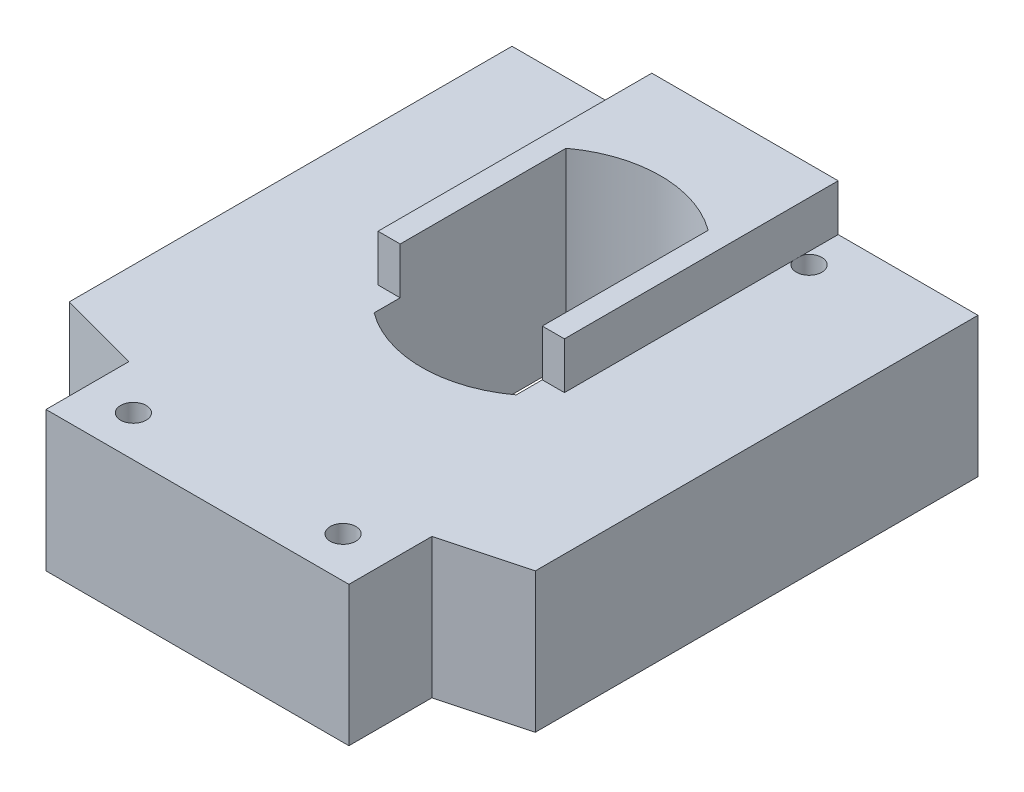
ISO-10303-21;
HEADER;
FILE_DESCRIPTION(('STEP AP214'),'2;1');
FILE_NAME('part.step','',(''),(''),'','','');
FILE_SCHEMA(('AUTOMOTIVE_DESIGN { 1 0 10303 214 1 1 1 1 }'));
ENDSEC;
DATA;
#1=APPLICATION_CONTEXT('core data for automotive mechanical design processes');
#2=APPLICATION_PROTOCOL_DEFINITION('international standard','automotive_design',2000,#1);
#3=PRODUCT_CONTEXT('',#1,'mechanical');
#4=PRODUCT('Part','Part','',(#3));
#5=PRODUCT_RELATED_PRODUCT_CATEGORY('part','',(#4));
#6=PRODUCT_DEFINITION_FORMATION('','',#4);
#7=PRODUCT_DEFINITION_CONTEXT('part definition',#1,'design');
#8=PRODUCT_DEFINITION('design','',#6,#7);
#9=PRODUCT_DEFINITION_SHAPE('','',#8);
#10=(LENGTH_UNIT() NAMED_UNIT(*) SI_UNIT(.MILLI.,.METRE.));
#11=(NAMED_UNIT(*) PLANE_ANGLE_UNIT() SI_UNIT($,.RADIAN.));
#12=(NAMED_UNIT(*) SI_UNIT($,.STERADIAN.) SOLID_ANGLE_UNIT());
#13=UNCERTAINTY_MEASURE_WITH_UNIT(LENGTH_MEASURE(1.E-05),#10,'distance_accuracy_value','');
#14=(GEOMETRIC_REPRESENTATION_CONTEXT(3) GLOBAL_UNCERTAINTY_ASSIGNED_CONTEXT((#13)) GLOBAL_UNIT_ASSIGNED_CONTEXT((#10,
#11,#12)) REPRESENTATION_CONTEXT('',''));
#15=CARTESIAN_POINT('',(0.,0.,0.));
#16=DIRECTION('',(0.,0.,1.));
#17=DIRECTION('',(1.,0.,0.));
#18=AXIS2_PLACEMENT_3D('',#15,#16,#17);
#19=CARTESIAN_POINT('',(0.,-12.,0.));
#20=DIRECTION('',(0.,1.,0.));
#21=DIRECTION('',(0.,0.,1.));
#22=AXIS2_PLACEMENT_3D('',#19,#20,#21);
#23=PLANE('',#22);
#24=CARTESIAN_POINT('',(-9.,-12.,-20.));
#25=DIRECTION('',(0.,1.,0.));
#26=DIRECTION('',(0.,0.,1.));
#27=AXIS2_PLACEMENT_3D('',#24,#25,#26);
#28=CIRCLE('',#27,1.1);
#29=CARTESIAN_POINT('',(-9.,-12.,-18.9));
#30=VERTEX_POINT('',#29);
#31=EDGE_CURVE('E283',#30,#30,#28,.T.);
#32=ORIENTED_EDGE('',*,*,#31,.T.);
#33=EDGE_LOOP('',(#32));
#34=FACE_BOUND('',#33,.T.);
#35=CARTESIAN_POINT('',(9.,-12.,-20.));
#36=DIRECTION('',(0.,1.,0.));
#37=DIRECTION('',(0.,0.,1.));
#38=AXIS2_PLACEMENT_3D('',#35,#36,#37);
#39=CIRCLE('',#38,1.1);
#40=CARTESIAN_POINT('',(9.,-12.,-18.9));
#41=VERTEX_POINT('',#40);
#42=EDGE_CURVE('E280',#41,#41,#39,.T.);
#43=ORIENTED_EDGE('',*,*,#42,.T.);
#44=EDGE_LOOP('',(#43));
#45=FACE_BOUND('',#44,.T.);
#46=CARTESIAN_POINT('',(-9.,-12.,20.));
#47=DIRECTION('',(0.,1.,0.));
#48=DIRECTION('',(0.,0.,1.));
#49=AXIS2_PLACEMENT_3D('',#46,#47,#48);
#50=CIRCLE('',#49,1.1);
#51=CARTESIAN_POINT('',(-9.,-12.,21.1));
#52=VERTEX_POINT('',#51);
#53=EDGE_CURVE('E277',#52,#52,#50,.T.);
#54=ORIENTED_EDGE('',*,*,#53,.T.);
#55=EDGE_LOOP('',(#54));
#56=FACE_BOUND('',#55,.T.);
#57=CARTESIAN_POINT('',(9.,-12.,20.));
#58=DIRECTION('',(0.,1.,0.));
#59=DIRECTION('',(0.,0.,1.));
#60=AXIS2_PLACEMENT_3D('',#57,#58,#59);
#61=CIRCLE('',#60,1.1);
#62=CARTESIAN_POINT('',(9.,-12.,21.1));
#63=VERTEX_POINT('',#62);
#64=EDGE_CURVE('E274',#63,#63,#61,.T.);
#65=ORIENTED_EDGE('',*,*,#64,.T.);
#66=EDGE_LOOP('',(#65));
#67=FACE_BOUND('',#66,.T.);
#68=DIRECTION('',(0.965925826289069,0.,0.258819045102518));
#69=VECTOR('',#68,1.);
#70=CARTESIAN_POINT('',(-4.96474596215555,-12.,18.5286841774372));
#71=LINE('',#70,#69);
#72=CARTESIAN_POINT('',(-20.,-12.,14.5));
#73=VERTEX_POINT('',#72);
#74=CARTESIAN_POINT('',(-13.,-12.,16.3756443470178));
#75=VERTEX_POINT('',#74);
#76=EDGE_CURVE('E252',#73,#75,#71,.T.);
#77=ORIENTED_EDGE('',*,*,#76,.F.);
#78=DIRECTION('',(0.,0.,1.));
#79=VECTOR('',#78,1.);
#80=CARTESIAN_POINT('',(-20.,-12.,0.));
#81=LINE('',#80,#79);
#82=CARTESIAN_POINT('',(-20.,-12.,-23.5));
#83=VERTEX_POINT('',#82);
#84=EDGE_CURVE('E271',#83,#73,#81,.T.);
#85=ORIENTED_EDGE('',*,*,#84,.F.);
#86=DIRECTION('',(-1.,0.,0.));
#87=VECTOR('',#86,1.);
#88=CARTESIAN_POINT('',(0.,-12.,-23.5));
#89=LINE('',#88,#87);
#90=CARTESIAN_POINT('',(20.,-12.,-23.5));
#91=VERTEX_POINT('',#90);
#92=EDGE_CURVE('E268',#91,#83,#89,.T.);
#93=ORIENTED_EDGE('',*,*,#92,.F.);
#94=DIRECTION('',(0.,0.,1.));
#95=VECTOR('',#94,1.);
#96=CARTESIAN_POINT('',(20.,-12.,0.));
#97=LINE('',#96,#95);
#98=CARTESIAN_POINT('',(20.,-12.,14.5));
#99=VERTEX_POINT('',#98);
#100=EDGE_CURVE('E266',#91,#99,#97,.T.);
#101=ORIENTED_EDGE('',*,*,#100,.T.);
#102=DIRECTION('',(-0.965925826289069,0.,0.258819045102518));
#103=VECTOR('',#102,1.);
#104=CARTESIAN_POINT('',(4.96474596215555,-12.,18.5286841774372));
#105=LINE('',#104,#103);
#106=CARTESIAN_POINT('',(13.,-12.,16.3756443470178));
#107=VERTEX_POINT('',#106);
#108=EDGE_CURVE('E264',#99,#107,#105,.T.);
#109=ORIENTED_EDGE('',*,*,#108,.T.);
#110=DIRECTION('',(0.,0.,1.));
#111=VECTOR('',#110,1.);
#112=CARTESIAN_POINT('',(13.,-12.,0.));
#113=LINE('',#112,#111);
#114=CARTESIAN_POINT('',(13.,-12.,23.5));
#115=VERTEX_POINT('',#114);
#116=EDGE_CURVE('E262',#107,#115,#113,.T.);
#117=ORIENTED_EDGE('',*,*,#116,.T.);
#118=DIRECTION('',(1.,0.,0.));
#119=VECTOR('',#118,1.);
#120=CARTESIAN_POINT('',(0.,-12.,23.5));
#121=LINE('',#120,#119);
#122=CARTESIAN_POINT('',(-13.,-12.,23.5));
#123=VERTEX_POINT('',#122);
#124=EDGE_CURVE('E259',#123,#115,#121,.T.);
#125=ORIENTED_EDGE('',*,*,#124,.F.);
#126=DIRECTION('',(0.,0.,1.));
#127=VECTOR('',#126,1.);
#128=CARTESIAN_POINT('',(-13.,-12.,0.));
#129=LINE('',#128,#127);
#130=EDGE_CURVE('E255',#75,#123,#129,.T.);
#131=ORIENTED_EDGE('',*,*,#130,.F.);
#132=EDGE_LOOP('',(#77,#85,#93,#101,#109,#117,#125,#131));
#133=FACE_BOUND('',#132,.T.);
#134=DIRECTION('',(0.,0.,1.));
#135=VECTOR('',#134,1.);
#136=CARTESIAN_POINT('',(6.1,-12.,0.));
#137=LINE('',#136,#135);
#138=CARTESIAN_POINT('',(6.1,-12.,-14.2372628949184));
#139=VERTEX_POINT('',#138);
#140=CARTESIAN_POINT('',(6.1,-12.,2.23726289491844));
#141=VERTEX_POINT('',#140);
#142=EDGE_CURVE('E198',#139,#141,#137,.T.);
#143=ORIENTED_EDGE('',*,*,#142,.F.);
#144=CARTESIAN_POINT('',(0.,-12.,-5.99999999999999));
#145=DIRECTION('',(0.,1.,0.));
#146=DIRECTION('',(0.,0.,1.));
#147=AXIS2_PLACEMENT_3D('',#144,#145,#146);
#148=CIRCLE('',#147,10.25);
#149=CARTESIAN_POINT('',(-6.1,-12.,-14.2372628949184));
#150=VERTEX_POINT('',#149);
#151=EDGE_CURVE('E182',#139,#150,#148,.T.);
#152=ORIENTED_EDGE('',*,*,#151,.T.);
#153=DIRECTION('',(0.,0.,1.));
#154=VECTOR('',#153,1.);
#155=CARTESIAN_POINT('',(-6.1,-12.,0.));
#156=LINE('',#155,#154);
#157=CARTESIAN_POINT('',(-6.1,-12.,2.23726289491844));
#158=VERTEX_POINT('',#157);
#159=EDGE_CURVE('E56',#150,#158,#156,.T.);
#160=ORIENTED_EDGE('',*,*,#159,.T.);
#161=EDGE_CURVE('E186',#158,#141,#148,.T.);
#162=ORIENTED_EDGE('',*,*,#161,.T.);
#163=EDGE_LOOP('',(#143,#152,#160,#162));
#164=FACE_BOUND('',#163,.T.);
#165=ADVANCED_FACE('F41',(#34,#45,#56,#67,#133,#164),#23,.F.);
#166=CARTESIAN_POINT('',(0.,0.,0.));
#167=DIRECTION('',(0.,1.,0.));
#168=DIRECTION('',(0.,0.,1.));
#169=AXIS2_PLACEMENT_3D('',#166,#167,#168);
#170=PLANE('',#169);
#171=CARTESIAN_POINT('',(9.,0.,20.));
#172=DIRECTION('',(0.,1.,0.));
#173=DIRECTION('',(0.,0.,1.));
#174=AXIS2_PLACEMENT_3D('',#171,#172,#173);
#175=CIRCLE('',#174,1.1);
#176=CARTESIAN_POINT('',(9.,0.,21.1));
#177=VERTEX_POINT('',#176);
#178=EDGE_CURVE('E308',#177,#177,#175,.T.);
#179=ORIENTED_EDGE('',*,*,#178,.F.);
#180=EDGE_LOOP('',(#179));
#181=FACE_BOUND('',#180,.T.);
#182=CARTESIAN_POINT('',(-9.,0.,20.));
#183=DIRECTION('',(0.,1.,0.));
#184=DIRECTION('',(0.,0.,1.));
#185=AXIS2_PLACEMENT_3D('',#182,#183,#184);
#186=CIRCLE('',#185,1.1);
#187=CARTESIAN_POINT('',(-9.,0.,21.1));
#188=VERTEX_POINT('',#187);
#189=EDGE_CURVE('E311',#188,#188,#186,.T.);
#190=ORIENTED_EDGE('',*,*,#189,.F.);
#191=EDGE_LOOP('',(#190));
#192=FACE_BOUND('',#191,.T.);
#193=DIRECTION('',(1.,0.,0.));
#194=VECTOR('',#193,1.);
#195=CARTESIAN_POINT('',(0.,0.,0.));
#196=LINE('',#195,#194);
#197=CARTESIAN_POINT('',(6.1,0.,0.));
#198=VERTEX_POINT('',#197);
#199=CARTESIAN_POINT('',(8.,0.,0.));
#200=VERTEX_POINT('',#199);
#201=EDGE_CURVE('E224',#198,#200,#196,.T.);
#202=ORIENTED_EDGE('',*,*,#201,.F.);
#203=DIRECTION('',(0.,0.,1.));
#204=VECTOR('',#203,1.);
#205=CARTESIAN_POINT('',(6.1,0.,0.));
#206=LINE('',#205,#204);
#207=CARTESIAN_POINT('',(6.1,0.,2.23726289491844));
#208=VERTEX_POINT('',#207);
#209=EDGE_CURVE('E213',#198,#208,#206,.T.);
#210=ORIENTED_EDGE('',*,*,#209,.T.);
#211=CARTESIAN_POINT('',(0.,0.,-5.99999999999999));
#212=DIRECTION('',(0.,1.,0.));
#213=DIRECTION('',(0.,0.,1.));
#214=AXIS2_PLACEMENT_3D('',#211,#212,#213);
#215=CIRCLE('',#214,10.25);
#216=CARTESIAN_POINT('',(-6.1,0.,2.23726289491844));
#217=VERTEX_POINT('',#216);
#218=EDGE_CURVE('E11',#217,#208,#215,.T.);
#219=ORIENTED_EDGE('',*,*,#218,.F.);
#220=DIRECTION('',(0.,0.,1.));
#221=VECTOR('',#220,1.);
#222=CARTESIAN_POINT('',(-6.1,0.,0.));
#223=LINE('',#222,#221);
#224=CARTESIAN_POINT('',(-6.1,0.,0.));
#225=VERTEX_POINT('',#224);
#226=EDGE_CURVE('E207',#225,#217,#223,.T.);
#227=ORIENTED_EDGE('',*,*,#226,.F.);
#228=CARTESIAN_POINT('',(-8.,0.,0.));
#229=VERTEX_POINT('',#228);
#230=EDGE_CURVE('E221',#229,#225,#196,.T.);
#231=ORIENTED_EDGE('',*,*,#230,.F.);
#232=DIRECTION('',(0.,0.,1.));
#233=VECTOR('',#232,1.);
#234=CARTESIAN_POINT('',(-8.,0.,-39.9924225024706));
#235=LINE('',#234,#233);
#236=CARTESIAN_POINT('',(-8.,0.,-19.5417424305044));
#237=VERTEX_POINT('',#236);
#238=EDGE_CURVE('E250',#237,#229,#235,.T.);
#239=ORIENTED_EDGE('',*,*,#238,.F.);
#240=CARTESIAN_POINT('',(-9.,0.,-20.));
#241=DIRECTION('',(0.,1.,0.));
#242=DIRECTION('',(0.,0.,1.));
#243=AXIS2_PLACEMENT_3D('',#240,#241,#242);
#244=CIRCLE('',#243,1.1);
#245=CARTESIAN_POINT('',(-8.,0.,-20.4582575694956));
#246=VERTEX_POINT('',#245);
#247=EDGE_CURVE('E318',#246,#237,#244,.T.);
#248=ORIENTED_EDGE('',*,*,#247,.F.);
#249=CARTESIAN_POINT('',(-8.,0.,-23.5));
#250=VERTEX_POINT('',#249);
#251=EDGE_CURVE('E228',#250,#246,#235,.T.);
#252=ORIENTED_EDGE('',*,*,#251,.F.);
#253=DIRECTION('',(-1.,0.,0.));
#254=VECTOR('',#253,1.);
#255=CARTESIAN_POINT('',(0.,0.,-23.5));
#256=LINE('',#255,#254);
#257=CARTESIAN_POINT('',(-20.,0.,-23.5));
#258=VERTEX_POINT('',#257);
#259=EDGE_CURVE('E302',#250,#258,#256,.T.);
#260=ORIENTED_EDGE('',*,*,#259,.T.);
#261=DIRECTION('',(0.,0.,1.));
#262=VECTOR('',#261,1.);
#263=CARTESIAN_POINT('',(-20.,0.,0.));
#264=LINE('',#263,#262);
#265=CARTESIAN_POINT('',(-20.,0.,14.5));
#266=VERTEX_POINT('',#265);
#267=EDGE_CURVE('E305',#258,#266,#264,.T.);
#268=ORIENTED_EDGE('',*,*,#267,.T.);
#269=DIRECTION('',(0.965925826289069,0.,0.258819045102518));
#270=VECTOR('',#269,1.);
#271=CARTESIAN_POINT('',(-4.96474596215555,0.,18.5286841774372));
#272=LINE('',#271,#270);
#273=CARTESIAN_POINT('',(-13.,0.,16.3756443470178));
#274=VERTEX_POINT('',#273);
#275=EDGE_CURVE('E238',#266,#274,#272,.T.);
#276=ORIENTED_EDGE('',*,*,#275,.T.);
#277=DIRECTION('',(0.,0.,1.));
#278=VECTOR('',#277,1.);
#279=CARTESIAN_POINT('',(-13.,0.,0.));
#280=LINE('',#279,#278);
#281=CARTESIAN_POINT('',(-13.,0.,23.5));
#282=VERTEX_POINT('',#281);
#283=EDGE_CURVE('E289',#274,#282,#280,.T.);
#284=ORIENTED_EDGE('',*,*,#283,.T.);
#285=DIRECTION('',(1.,0.,0.));
#286=VECTOR('',#285,1.);
#287=CARTESIAN_POINT('',(0.,0.,23.5));
#288=LINE('',#287,#286);
#289=CARTESIAN_POINT('',(13.,0.,23.5));
#290=VERTEX_POINT('',#289);
#291=EDGE_CURVE('E292',#282,#290,#288,.T.);
#292=ORIENTED_EDGE('',*,*,#291,.T.);
#293=DIRECTION('',(0.,0.,1.));
#294=VECTOR('',#293,1.);
#295=CARTESIAN_POINT('',(13.,0.,0.));
#296=LINE('',#295,#294);
#297=CARTESIAN_POINT('',(13.,0.,16.3756443470178));
#298=VERTEX_POINT('',#297);
#299=EDGE_CURVE('E295',#298,#290,#296,.T.);
#300=ORIENTED_EDGE('',*,*,#299,.F.);
#301=DIRECTION('',(-0.965925826289069,0.,0.258819045102518));
#302=VECTOR('',#301,1.);
#303=CARTESIAN_POINT('',(4.96474596215555,0.,18.5286841774372));
#304=LINE('',#303,#302);
#305=CARTESIAN_POINT('',(20.,0.,14.5));
#306=VERTEX_POINT('',#305);
#307=EDGE_CURVE('E298',#306,#298,#304,.T.);
#308=ORIENTED_EDGE('',*,*,#307,.F.);
#309=DIRECTION('',(0.,0.,1.));
#310=VECTOR('',#309,1.);
#311=CARTESIAN_POINT('',(20.,0.,0.));
#312=LINE('',#311,#310);
#313=CARTESIAN_POINT('',(20.,0.,-23.5));
#314=VERTEX_POINT('',#313);
#315=EDGE_CURVE('E300',#314,#306,#312,.T.);
#316=ORIENTED_EDGE('',*,*,#315,.F.);
#317=CARTESIAN_POINT('',(8.,0.,-23.5));
#318=VERTEX_POINT('',#317);
#319=EDGE_CURVE('E303',#314,#318,#256,.T.);
#320=ORIENTED_EDGE('',*,*,#319,.T.);
#321=DIRECTION('',(0.,0.,1.));
#322=VECTOR('',#321,1.);
#323=CARTESIAN_POINT('',(8.,0.,-39.9924225024706));
#324=LINE('',#323,#322);
#325=CARTESIAN_POINT('',(8.,0.,-20.4582575694956));
#326=VERTEX_POINT('',#325);
#327=EDGE_CURVE('E244',#318,#326,#324,.T.);
#328=ORIENTED_EDGE('',*,*,#327,.T.);
#329=CARTESIAN_POINT('',(9.,0.,-20.));
#330=DIRECTION('',(0.,1.,0.));
#331=DIRECTION('',(0.,0.,1.));
#332=AXIS2_PLACEMENT_3D('',#329,#330,#331);
#333=CIRCLE('',#332,1.1);
#334=CARTESIAN_POINT('',(8.,0.,-19.5417424305044));
#335=VERTEX_POINT('',#334);
#336=EDGE_CURVE('E314',#335,#326,#333,.T.);
#337=ORIENTED_EDGE('',*,*,#336,.F.);
#338=EDGE_CURVE('E247',#335,#200,#324,.T.);
#339=ORIENTED_EDGE('',*,*,#338,.T.);
#340=EDGE_LOOP('',(#202,#210,#219,#227,#231,#239,#248,#252,#260,#268,#276,#284,#292,#300,#308,
#316,#320,#328,#337,#339));
#341=FACE_BOUND('',#340,.T.);
#342=ADVANCED_FACE('F345',(#181,#192,#341),#170,.T.);
#343=CARTESIAN_POINT('',(0.,4.,-39.9924225024706));
#344=DIRECTION('',(0.,-1.,0.));
#345=DIRECTION('',(0.,0.,-1.));
#346=AXIS2_PLACEMENT_3D('',#343,#344,#345);
#347=PLANE('',#346);
#348=DIRECTION('',(0.,0.,1.));
#349=VECTOR('',#348,1.);
#350=CARTESIAN_POINT('',(6.1,4.,0.));
#351=LINE('',#350,#349);
#352=CARTESIAN_POINT('',(6.1,4.,-14.2372628949184));
#353=VERTEX_POINT('',#352);
#354=CARTESIAN_POINT('',(6.1,4.,0.));
#355=VERTEX_POINT('',#354);
#356=EDGE_CURVE('E189',#353,#355,#351,.T.);
#357=ORIENTED_EDGE('',*,*,#356,.T.);
#358=DIRECTION('',(1.,0.,0.));
#359=VECTOR('',#358,1.);
#360=CARTESIAN_POINT('',(0.,4.,0.));
#361=LINE('',#360,#359);
#362=CARTESIAN_POINT('',(8.,4.,0.));
#363=VERTEX_POINT('',#362);
#364=EDGE_CURVE('E232',#355,#363,#361,.T.);
#365=ORIENTED_EDGE('',*,*,#364,.T.);
#366=DIRECTION('',(0.,0.,1.));
#367=VECTOR('',#366,1.);
#368=CARTESIAN_POINT('',(8.,4.,-39.9924225024706));
#369=LINE('',#368,#367);
#370=CARTESIAN_POINT('',(8.,4.,-23.5));
#371=VERTEX_POINT('',#370);
#372=EDGE_CURVE('E234',#371,#363,#369,.T.);
#373=ORIENTED_EDGE('',*,*,#372,.F.);
#374=DIRECTION('',(1.,0.,0.));
#375=VECTOR('',#374,1.);
#376=CARTESIAN_POINT('',(0.,4.,-23.5));
#377=LINE('',#376,#375);
#378=CARTESIAN_POINT('',(-8.,4.,-23.5));
#379=VERTEX_POINT('',#378);
#380=EDGE_CURVE('E235',#379,#371,#377,.T.);
#381=ORIENTED_EDGE('',*,*,#380,.F.);
#382=DIRECTION('',(0.,0.,1.));
#383=VECTOR('',#382,1.);
#384=CARTESIAN_POINT('',(-8.,4.,-39.9924225024706));
#385=LINE('',#384,#383);
#386=CARTESIAN_POINT('',(-8.,4.,0.));
#387=VERTEX_POINT('',#386);
#388=EDGE_CURVE('E216',#379,#387,#385,.T.);
#389=ORIENTED_EDGE('',*,*,#388,.T.);
#390=CARTESIAN_POINT('',(-6.1,4.,0.));
#391=VERTEX_POINT('',#390);
#392=EDGE_CURVE('E229',#387,#391,#361,.T.);
#393=ORIENTED_EDGE('',*,*,#392,.T.);
#394=DIRECTION('',(0.,0.,1.));
#395=VECTOR('',#394,1.);
#396=CARTESIAN_POINT('',(-6.1,4.,0.));
#397=LINE('',#396,#395);
#398=CARTESIAN_POINT('',(-6.1,4.,-14.2372628949184));
#399=VERTEX_POINT('',#398);
#400=EDGE_CURVE('E62',#399,#391,#397,.T.);
#401=ORIENTED_EDGE('',*,*,#400,.F.);
#402=CARTESIAN_POINT('',(0.,4.,-5.99999999999999));
#403=DIRECTION('',(0.,1.,0.));
#404=DIRECTION('',(0.,0.,1.));
#405=AXIS2_PLACEMENT_3D('',#402,#403,#404);
#406=CIRCLE('',#405,10.25);
#407=EDGE_CURVE('E180',#353,#399,#406,.T.);
#408=ORIENTED_EDGE('',*,*,#407,.F.);
#409=EDGE_LOOP('',(#357,#365,#373,#381,#389,#393,#401,#408));
#410=FACE_BOUND('',#409,.T.);
#411=ADVANCED_FACE('F195',(#410),#347,.F.);
#412=CARTESIAN_POINT('',(0.,0.,0.));
#413=DIRECTION('',(0.,0.,1.));
#414=DIRECTION('',(1.,0.,0.));
#415=AXIS2_PLACEMENT_3D('',#412,#413,#414);
#416=PLANE('',#415);
#417=ORIENTED_EDGE('',*,*,#364,.F.);
#418=DIRECTION('',(0.,-1.,0.));
#419=VECTOR('',#418,1.);
#420=CARTESIAN_POINT('',(6.1,0.,0.));
#421=LINE('',#420,#419);
#422=EDGE_CURVE('E49',#355,#198,#421,.T.);
#423=ORIENTED_EDGE('',*,*,#422,.T.);
#424=ORIENTED_EDGE('',*,*,#201,.T.);
#425=DIRECTION('',(0.,1.,0.));
#426=VECTOR('',#425,1.);
#427=CARTESIAN_POINT('',(8.,0.,0.));
#428=LINE('',#427,#426);
#429=EDGE_CURVE('E217',#200,#363,#428,.T.);
#430=ORIENTED_EDGE('',*,*,#429,.T.);
#431=EDGE_LOOP('',(#417,#423,#424,#430));
#432=FACE_BOUND('',#431,.T.);
#433=ADVANCED_FACE('F342',(#432),#416,.T.);
#434=CARTESIAN_POINT('',(-4.96474596215555,-12.,18.5286841774372));
#435=DIRECTION('',(-0.258819045102518,0.,0.965925826289069));
#436=DIRECTION('',(0.965925826289069,0.,0.258819045102518));
#437=AXIS2_PLACEMENT_3D('',#434,#435,#436);
#438=PLANE('',#437);
#439=ORIENTED_EDGE('',*,*,#275,.F.);
#440=DIRECTION('',(0.,1.,0.));
#441=VECTOR('',#440,1.);
#442=CARTESIAN_POINT('',(-20.,-12.,14.5));
#443=LINE('',#442,#441);
#444=EDGE_CURVE('E321',#73,#266,#443,.T.);
#445=ORIENTED_EDGE('',*,*,#444,.F.);
#446=ORIENTED_EDGE('',*,*,#76,.T.);
#447=DIRECTION('',(0.,1.,0.));
#448=VECTOR('',#447,1.);
#449=CARTESIAN_POINT('',(-13.,-12.,16.3756443470178));
#450=LINE('',#449,#448);
#451=EDGE_CURVE('E286',#75,#274,#450,.T.);
#452=ORIENTED_EDGE('',*,*,#451,.T.);
#453=EDGE_LOOP('',(#439,#445,#446,#452));
#454=FACE_BOUND('',#453,.T.);
#455=ADVANCED_FACE('F43',(#454),#438,.T.);
#456=CARTESIAN_POINT('',(-20.,-12.,0.));
#457=DIRECTION('',(-1.,0.,0.));
#458=DIRECTION('',(0.,0.,1.));
#459=AXIS2_PLACEMENT_3D('',#456,#457,#458);
#460=PLANE('',#459);
#461=ORIENTED_EDGE('',*,*,#267,.F.);
#462=DIRECTION('',(0.,1.,0.));
#463=VECTOR('',#462,1.);
#464=CARTESIAN_POINT('',(-20.,-12.,-23.5));
#465=LINE('',#464,#463);
#466=EDGE_CURVE('E323',#83,#258,#465,.T.);
#467=ORIENTED_EDGE('',*,*,#466,.F.);
#468=ORIENTED_EDGE('',*,*,#84,.T.);
#469=ORIENTED_EDGE('',*,*,#444,.T.);
#470=EDGE_LOOP('',(#461,#467,#468,#469));
#471=FACE_BOUND('',#470,.T.);
#472=ADVANCED_FACE('F411',(#471),#460,.T.);
#473=CARTESIAN_POINT('',(0.,-12.,-23.5));
#474=DIRECTION('',(0.,0.,-1.));
#475=DIRECTION('',(-1.,0.,0.));
#476=AXIS2_PLACEMENT_3D('',#473,#474,#475);
#477=PLANE('',#476);
#478=ORIENTED_EDGE('',*,*,#319,.F.);
#479=DIRECTION('',(0.,1.,0.));
#480=VECTOR('',#479,1.);
#481=CARTESIAN_POINT('',(20.,-12.,-23.5));
#482=LINE('',#481,#480);
#483=EDGE_CURVE('E326',#91,#314,#482,.T.);
#484=ORIENTED_EDGE('',*,*,#483,.F.);
#485=ORIENTED_EDGE('',*,*,#92,.T.);
#486=ORIENTED_EDGE('',*,*,#466,.T.);
#487=ORIENTED_EDGE('',*,*,#259,.F.);
#488=DIRECTION('',(0.,1.,0.));
#489=VECTOR('',#488,1.);
#490=CARTESIAN_POINT('',(-8.,0.,-23.5));
#491=LINE('',#490,#489);
#492=EDGE_CURVE('E220',#250,#379,#491,.T.);
#493=ORIENTED_EDGE('',*,*,#492,.T.);
#494=ORIENTED_EDGE('',*,*,#380,.T.);
#495=DIRECTION('',(0.,1.,0.));
#496=VECTOR('',#495,1.);
#497=CARTESIAN_POINT('',(8.,0.,-23.5));
#498=LINE('',#497,#496);
#499=EDGE_CURVE('E231',#318,#371,#498,.T.);
#500=ORIENTED_EDGE('',*,*,#499,.F.);
#501=EDGE_LOOP('',(#478,#484,#485,#486,#487,#493,#494,#500));
#502=FACE_BOUND('',#501,.T.);
#503=ADVANCED_FACE('F360',(#502),#477,.T.);
#504=CARTESIAN_POINT('',(20.,-12.,0.));
#505=DIRECTION('',(-1.,0.,0.));
#506=DIRECTION('',(0.,0.,1.));
#507=AXIS2_PLACEMENT_3D('',#504,#505,#506);
#508=PLANE('',#507);
#509=ORIENTED_EDGE('',*,*,#315,.T.);
#510=DIRECTION('',(0.,1.,0.));
#511=VECTOR('',#510,1.);
#512=CARTESIAN_POINT('',(20.,-12.,14.5));
#513=LINE('',#512,#511);
#514=EDGE_CURVE('E328',#99,#306,#513,.T.);
#515=ORIENTED_EDGE('',*,*,#514,.F.);
#516=ORIENTED_EDGE('',*,*,#100,.F.);
#517=ORIENTED_EDGE('',*,*,#483,.T.);
#518=EDGE_LOOP('',(#509,#515,#516,#517));
#519=FACE_BOUND('',#518,.T.);
#520=ADVANCED_FACE('F417',(#519),#508,.F.);
#521=CARTESIAN_POINT('',(4.96474596215555,-12.,18.5286841774372));
#522=DIRECTION('',(-0.258819045102518,0.,-0.965925826289069));
#523=DIRECTION('',(-0.965925826289069,0.,0.258819045102518));
#524=AXIS2_PLACEMENT_3D('',#521,#522,#523);
#525=PLANE('',#524);
#526=ORIENTED_EDGE('',*,*,#307,.T.);
#527=DIRECTION('',(0.,1.,0.));
#528=VECTOR('',#527,1.);
#529=CARTESIAN_POINT('',(13.,-12.,16.3756443470178));
#530=LINE('',#529,#528);
#531=EDGE_CURVE('E331',#107,#298,#530,.T.);
#532=ORIENTED_EDGE('',*,*,#531,.F.);
#533=ORIENTED_EDGE('',*,*,#108,.F.);
#534=ORIENTED_EDGE('',*,*,#514,.T.);
#535=EDGE_LOOP('',(#526,#532,#533,#534));
#536=FACE_BOUND('',#535,.T.);
#537=ADVANCED_FACE('F420',(#536),#525,.F.);
#538=CARTESIAN_POINT('',(13.,-12.,0.));
#539=DIRECTION('',(-1.,0.,0.));
#540=DIRECTION('',(0.,0.,1.));
#541=AXIS2_PLACEMENT_3D('',#538,#539,#540);
#542=PLANE('',#541);
#543=ORIENTED_EDGE('',*,*,#299,.T.);
#544=DIRECTION('',(0.,1.,0.));
#545=VECTOR('',#544,1.);
#546=CARTESIAN_POINT('',(13.,-12.,23.5));
#547=LINE('',#546,#545);
#548=EDGE_CURVE('E334',#115,#290,#547,.T.);
#549=ORIENTED_EDGE('',*,*,#548,.F.);
#550=ORIENTED_EDGE('',*,*,#116,.F.);
#551=ORIENTED_EDGE('',*,*,#531,.T.);
#552=EDGE_LOOP('',(#543,#549,#550,#551));
#553=FACE_BOUND('',#552,.T.);
#554=ADVANCED_FACE('F424',(#553),#542,.F.);
#555=CARTESIAN_POINT('',(0.,-12.,23.5));
#556=DIRECTION('',(0.,0.,1.));
#557=DIRECTION('',(1.,0.,0.));
#558=AXIS2_PLACEMENT_3D('',#555,#556,#557);
#559=PLANE('',#558);
#560=ORIENTED_EDGE('',*,*,#291,.F.);
#561=DIRECTION('',(0.,1.,0.));
#562=VECTOR('',#561,1.);
#563=CARTESIAN_POINT('',(-13.,-12.,23.5));
#564=LINE('',#563,#562);
#565=EDGE_CURVE('E336',#123,#282,#564,.T.);
#566=ORIENTED_EDGE('',*,*,#565,.F.);
#567=ORIENTED_EDGE('',*,*,#124,.T.);
#568=ORIENTED_EDGE('',*,*,#548,.T.);
#569=EDGE_LOOP('',(#560,#566,#567,#568));
#570=FACE_BOUND('',#569,.T.);
#571=ADVANCED_FACE('F402',(#570),#559,.T.);
#572=CARTESIAN_POINT('',(9.,-12.,-20.));
#573=DIRECTION('',(0.,1.,0.));
#574=DIRECTION('',(0.,0.,1.));
#575=AXIS2_PLACEMENT_3D('',#572,#573,#574);
#576=CYLINDRICAL_SURFACE('',#575,1.1);
#577=ORIENTED_EDGE('',*,*,#42,.F.);
#578=EDGE_LOOP('',(#577));
#579=FACE_BOUND('',#578,.T.);
#580=EDGE_CURVE('E315',#326,#335,#333,.T.);
#581=ORIENTED_EDGE('',*,*,#580,.T.);
#582=ORIENTED_EDGE('',*,*,#336,.T.);
#583=EDGE_LOOP('',(#581,#582));
#584=FACE_BOUND('',#583,.T.);
#585=ADVANCED_FACE('F398',(#579,#584),#576,.F.);
#586=CARTESIAN_POINT('',(-9.,-12.,20.));
#587=DIRECTION('',(0.,1.,0.));
#588=DIRECTION('',(0.,0.,1.));
#589=AXIS2_PLACEMENT_3D('',#586,#587,#588);
#590=CYLINDRICAL_SURFACE('',#589,1.1);
#591=ORIENTED_EDGE('',*,*,#53,.F.);
#592=EDGE_LOOP('',(#591));
#593=FACE_BOUND('',#592,.T.);
#594=ORIENTED_EDGE('',*,*,#189,.T.);
#595=EDGE_LOOP('',(#594));
#596=FACE_BOUND('',#595,.T.);
#597=ADVANCED_FACE('F401',(#593,#596),#590,.F.);
#598=CARTESIAN_POINT('',(9.,-12.,20.));
#599=DIRECTION('',(0.,1.,0.));
#600=DIRECTION('',(0.,0.,1.));
#601=AXIS2_PLACEMENT_3D('',#598,#599,#600);
#602=CYLINDRICAL_SURFACE('',#601,1.1);
#603=ORIENTED_EDGE('',*,*,#64,.F.);
#604=EDGE_LOOP('',(#603));
#605=FACE_BOUND('',#604,.T.);
#606=ORIENTED_EDGE('',*,*,#178,.T.);
#607=EDGE_LOOP('',(#606));
#608=FACE_BOUND('',#607,.T.);
#609=ADVANCED_FACE('F406',(#605,#608),#602,.F.);
#610=CARTESIAN_POINT('',(-13.,-12.,0.));
#611=DIRECTION('',(-1.,0.,0.));
#612=DIRECTION('',(0.,0.,1.));
#613=AXIS2_PLACEMENT_3D('',#610,#611,#612);
#614=PLANE('',#613);
#615=ORIENTED_EDGE('',*,*,#283,.F.);
#616=ORIENTED_EDGE('',*,*,#451,.F.);
#617=ORIENTED_EDGE('',*,*,#130,.T.);
#618=ORIENTED_EDGE('',*,*,#565,.T.);
#619=EDGE_LOOP('',(#615,#616,#617,#618));
#620=FACE_BOUND('',#619,.T.);
#621=ADVANCED_FACE('F396',(#620),#614,.T.);
#622=CARTESIAN_POINT('',(-9.,-12.,-20.));
#623=DIRECTION('',(0.,1.,0.));
#624=DIRECTION('',(0.,0.,1.));
#625=AXIS2_PLACEMENT_3D('',#622,#623,#624);
#626=CYLINDRICAL_SURFACE('',#625,1.1);
#627=ORIENTED_EDGE('',*,*,#31,.F.);
#628=EDGE_LOOP('',(#627));
#629=FACE_BOUND('',#628,.T.);
#630=EDGE_CURVE('E256',#237,#246,#244,.T.);
#631=ORIENTED_EDGE('',*,*,#630,.T.);
#632=ORIENTED_EDGE('',*,*,#247,.T.);
#633=EDGE_LOOP('',(#631,#632));
#634=FACE_BOUND('',#633,.T.);
#635=ADVANCED_FACE('F392',(#629,#634),#626,.F.);
#636=CARTESIAN_POINT('',(0.,0.,-39.9924225024706));
#637=DIRECTION('',(0.,-1.,0.));
#638=DIRECTION('',(0.,0.,-1.));
#639=AXIS2_PLACEMENT_3D('',#636,#637,#638);
#640=PLANE('',#639);
#641=ORIENTED_EDGE('',*,*,#580,.F.);
#642=EDGE_CURVE('E243',#326,#335,#324,.T.);
#643=ORIENTED_EDGE('',*,*,#642,.T.);
#644=EDGE_LOOP('',(#641,#643));
#645=FACE_BOUND('',#644,.T.);
#646=ADVANCED_FACE('F395',(#645),#640,.T.);
#647=ORIENTED_EDGE('',*,*,#630,.F.);
#648=EDGE_CURVE('E246',#246,#237,#235,.T.);
#649=ORIENTED_EDGE('',*,*,#648,.F.);
#650=EDGE_LOOP('',(#647,#649));
#651=FACE_BOUND('',#650,.T.);
#652=ADVANCED_FACE('F459',(#651),#640,.T.);
#653=CARTESIAN_POINT('',(8.,0.,-39.9924225024706));
#654=DIRECTION('',(1.,0.,0.));
#655=DIRECTION('',(0.,0.,-1.));
#656=AXIS2_PLACEMENT_3D('',#653,#654,#655);
#657=PLANE('',#656);
#658=ORIENTED_EDGE('',*,*,#327,.F.);
#659=ORIENTED_EDGE('',*,*,#499,.T.);
#660=ORIENTED_EDGE('',*,*,#372,.T.);
#661=ORIENTED_EDGE('',*,*,#429,.F.);
#662=ORIENTED_EDGE('',*,*,#338,.F.);
#663=ORIENTED_EDGE('',*,*,#642,.F.);
#664=EDGE_LOOP('',(#658,#659,#660,#661,#662,#663));
#665=FACE_BOUND('',#664,.T.);
#666=ADVANCED_FACE('F354',(#665),#657,.T.);
#667=CARTESIAN_POINT('',(-8.,0.,-39.9924225024706));
#668=DIRECTION('',(1.,0.,0.));
#669=DIRECTION('',(0.,0.,-1.));
#670=AXIS2_PLACEMENT_3D('',#667,#668,#669);
#671=PLANE('',#670);
#672=ORIENTED_EDGE('',*,*,#492,.F.);
#673=ORIENTED_EDGE('',*,*,#251,.T.);
#674=ORIENTED_EDGE('',*,*,#648,.T.);
#675=ORIENTED_EDGE('',*,*,#238,.T.);
#676=DIRECTION('',(0.,1.,0.));
#677=VECTOR('',#676,1.);
#678=CARTESIAN_POINT('',(-8.,0.,0.));
#679=LINE('',#678,#677);
#680=EDGE_CURVE('E225',#229,#387,#679,.T.);
#681=ORIENTED_EDGE('',*,*,#680,.T.);
#682=ORIENTED_EDGE('',*,*,#388,.F.);
#683=EDGE_LOOP('',(#672,#673,#674,#675,#681,#682));
#684=FACE_BOUND('',#683,.T.);
#685=ADVANCED_FACE('F364',(#684),#671,.F.);
#686=DIRECTION('',(0.,-1.,0.));
#687=VECTOR('',#686,1.);
#688=CARTESIAN_POINT('',(-6.1,0.,0.));
#689=LINE('',#688,#687);
#690=EDGE_CURVE('E339',#391,#225,#689,.T.);
#691=ORIENTED_EDGE('',*,*,#690,.F.);
#692=ORIENTED_EDGE('',*,*,#392,.F.);
#693=ORIENTED_EDGE('',*,*,#680,.F.);
#694=ORIENTED_EDGE('',*,*,#230,.T.);
#695=EDGE_LOOP('',(#691,#692,#693,#694));
#696=FACE_BOUND('',#695,.T.);
#697=ADVANCED_FACE('F370',(#696),#416,.T.);
#698=CARTESIAN_POINT('',(6.1,-12.,0.));
#699=DIRECTION('',(-1.,0.,0.));
#700=DIRECTION('',(0.,0.,1.));
#701=AXIS2_PLACEMENT_3D('',#698,#699,#700);
#702=PLANE('',#701);
#703=ORIENTED_EDGE('',*,*,#422,.F.);
#704=ORIENTED_EDGE('',*,*,#356,.F.);
#705=DIRECTION('',(0.,1.,0.));
#706=VECTOR('',#705,1.);
#707=CARTESIAN_POINT('',(6.1,-12.,-14.2372628949184));
#708=LINE('',#707,#706);
#709=EDGE_CURVE('E176',#139,#353,#708,.T.);
#710=ORIENTED_EDGE('',*,*,#709,.F.);
#711=ORIENTED_EDGE('',*,*,#142,.T.);
#712=DIRECTION('',(0.,1.,0.));
#713=VECTOR('',#712,1.);
#714=CARTESIAN_POINT('',(6.1,-12.,2.23726289491844));
#715=LINE('',#714,#713);
#716=EDGE_CURVE('E204',#141,#208,#715,.T.);
#717=ORIENTED_EDGE('',*,*,#716,.T.);
#718=ORIENTED_EDGE('',*,*,#209,.F.);
#719=EDGE_LOOP('',(#703,#704,#710,#711,#717,#718));
#720=FACE_BOUND('',#719,.T.);
#721=ADVANCED_FACE('F190',(#720),#702,.T.);
#722=CARTESIAN_POINT('',(0.,-12.,-5.99999999999999));
#723=DIRECTION('',(0.,1.,0.));
#724=DIRECTION('',(0.,0.,1.));
#725=AXIS2_PLACEMENT_3D('',#722,#723,#724);
#726=CYLINDRICAL_SURFACE('',#725,10.25);
#727=ORIENTED_EDGE('',*,*,#218,.T.);
#728=ORIENTED_EDGE('',*,*,#716,.F.);
#729=ORIENTED_EDGE('',*,*,#161,.F.);
#730=DIRECTION('',(0.,1.,0.));
#731=VECTOR('',#730,1.);
#732=CARTESIAN_POINT('',(-6.1,-12.,2.23726289491844));
#733=LINE('',#732,#731);
#734=EDGE_CURVE('E208',#158,#217,#733,.T.);
#735=ORIENTED_EDGE('',*,*,#734,.T.);
#736=EDGE_LOOP('',(#727,#728,#729,#735));
#737=FACE_BOUND('',#736,.T.);
#738=ADVANCED_FACE('F375',(#737),#726,.F.);
#739=CARTESIAN_POINT('',(-6.1,-12.,0.));
#740=DIRECTION('',(-1.,0.,0.));
#741=DIRECTION('',(0.,0.,1.));
#742=AXIS2_PLACEMENT_3D('',#739,#740,#741);
#743=PLANE('',#742);
#744=ORIENTED_EDGE('',*,*,#226,.T.);
#745=ORIENTED_EDGE('',*,*,#734,.F.);
#746=ORIENTED_EDGE('',*,*,#159,.F.);
#747=DIRECTION('',(0.,1.,0.));
#748=VECTOR('',#747,1.);
#749=CARTESIAN_POINT('',(-6.1,-12.,-14.2372628949184));
#750=LINE('',#749,#748);
#751=EDGE_CURVE('E185',#150,#399,#750,.T.);
#752=ORIENTED_EDGE('',*,*,#751,.T.);
#753=ORIENTED_EDGE('',*,*,#400,.T.);
#754=ORIENTED_EDGE('',*,*,#690,.T.);
#755=EDGE_LOOP('',(#744,#745,#746,#752,#753,#754));
#756=FACE_BOUND('',#755,.T.);
#757=ADVANCED_FACE('F372',(#756),#743,.F.);
#758=ORIENTED_EDGE('',*,*,#751,.F.);
#759=ORIENTED_EDGE('',*,*,#151,.F.);
#760=ORIENTED_EDGE('',*,*,#709,.T.);
#761=ORIENTED_EDGE('',*,*,#407,.T.);
#762=EDGE_LOOP('',(#758,#759,#760,#761));
#763=FACE_BOUND('',#762,.T.);
#764=ADVANCED_FACE('F178',(#763),#726,.F.);
#765=CLOSED_SHELL('',(#165,#342,#411,#433,#455,#472,#503,#520,#537,#554,#571,#585,#597,#609,
#621,#635,#646,#652,#666,#685,#697,#721,#738,#757,#764));
#766=MANIFOLD_SOLID_BREP('B2',#765);
#767=ADVANCED_BREP_SHAPE_REPRESENTATION('',(#18,#766),#14);
#768=SHAPE_DEFINITION_REPRESENTATION(#9,#767);
ENDSEC;
END-ISO-10303-21;
